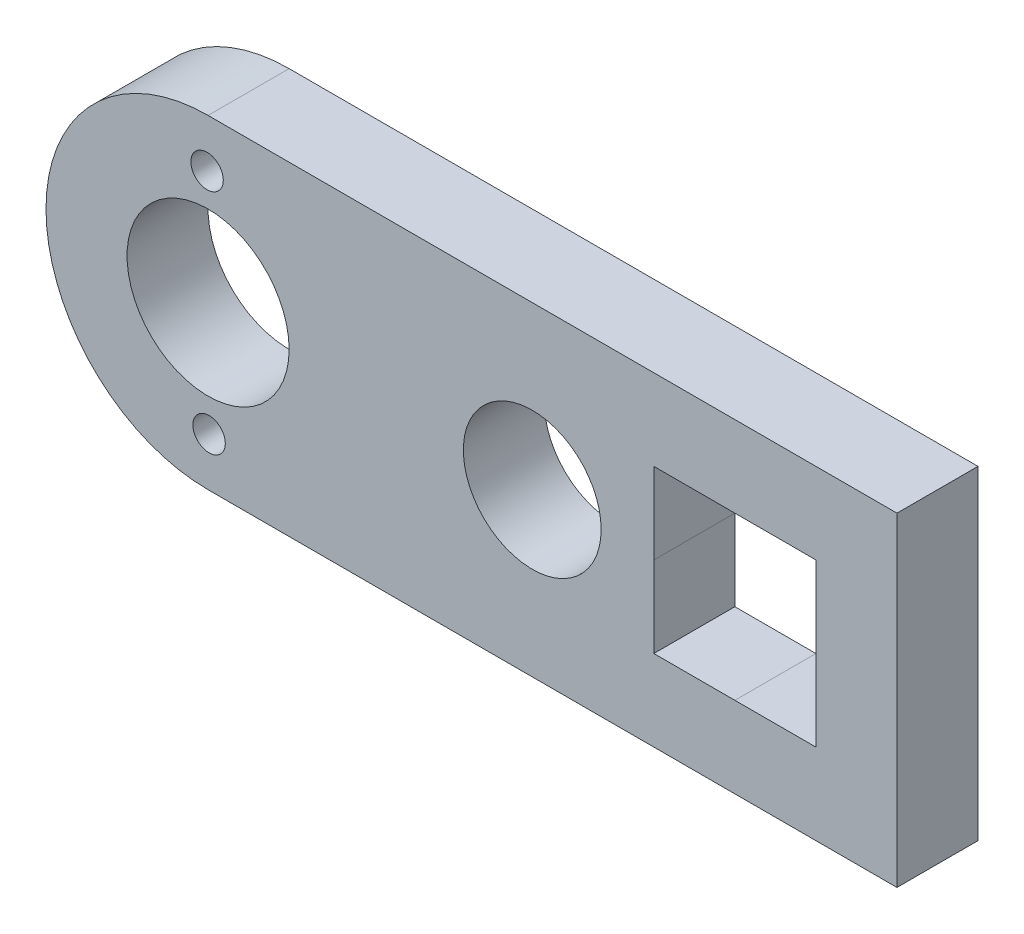
ISO-10303-21;
HEADER;
FILE_DESCRIPTION(('STEP AP214'),'2;1');
FILE_NAME('part.step','',(''),(''),'','','');
FILE_SCHEMA(('AUTOMOTIVE_DESIGN { 1 0 10303 214 1 1 1 1 }'));
ENDSEC;
DATA;
#1=APPLICATION_CONTEXT('core data for automotive mechanical design processes');
#2=APPLICATION_PROTOCOL_DEFINITION('international standard','automotive_design',2000,#1);
#3=PRODUCT_CONTEXT('',#1,'mechanical');
#4=PRODUCT('Part','Part','',(#3));
#5=PRODUCT_RELATED_PRODUCT_CATEGORY('part','',(#4));
#6=PRODUCT_DEFINITION_FORMATION('','',#4);
#7=PRODUCT_DEFINITION_CONTEXT('part definition',#1,'design');
#8=PRODUCT_DEFINITION('design','',#6,#7);
#9=PRODUCT_DEFINITION_SHAPE('','',#8);
#10=(LENGTH_UNIT() NAMED_UNIT(*) SI_UNIT(.MILLI.,.METRE.));
#11=(NAMED_UNIT(*) PLANE_ANGLE_UNIT() SI_UNIT($,.RADIAN.));
#12=(NAMED_UNIT(*) SI_UNIT($,.STERADIAN.) SOLID_ANGLE_UNIT());
#13=UNCERTAINTY_MEASURE_WITH_UNIT(LENGTH_MEASURE(1.E-05),#10,'distance_accuracy_value','');
#14=(GEOMETRIC_REPRESENTATION_CONTEXT(3) GLOBAL_UNCERTAINTY_ASSIGNED_CONTEXT((#13)) GLOBAL_UNIT_ASSIGNED_CONTEXT((#10,
#11,#12)) REPRESENTATION_CONTEXT('',''));
#15=CARTESIAN_POINT('',(0.,0.,0.));
#16=DIRECTION('',(0.,0.,1.));
#17=DIRECTION('',(1.,0.,0.));
#18=AXIS2_PLACEMENT_3D('',#15,#16,#17);
#19=CARTESIAN_POINT('',(0.,0.,5.));
#20=DIRECTION('',(0.,0.,1.));
#21=DIRECTION('',(1.,0.,0.));
#22=AXIS2_PLACEMENT_3D('',#19,#20,#21);
#23=PLANE('',#22);
#24=CARTESIAN_POINT('',(0.0624545754265805,-7.,5.));
#25=DIRECTION('',(0.,0.,1.));
#26=DIRECTION('',(1.,0.,0.));
#27=AXIS2_PLACEMENT_3D('',#24,#25,#26);
#28=CIRCLE('',#27,1.);
#29=CARTESIAN_POINT('',(1.06245457542658,-7.,5.));
#30=VERTEX_POINT('',#29);
#31=EDGE_CURVE('E349',#30,#30,#28,.T.);
#32=ORIENTED_EDGE('',*,*,#31,.F.);
#33=EDGE_LOOP('',(#32));
#34=FACE_BOUND('',#33,.T.);
#35=CARTESIAN_POINT('',(-0.0624545754265831,7.,5.));
#36=DIRECTION('',(0.,0.,1.));
#37=DIRECTION('',(1.,0.,0.));
#38=AXIS2_PLACEMENT_3D('',#35,#36,#37);
#39=CIRCLE('',#38,1.);
#40=CARTESIAN_POINT('',(0.937545424573417,7.,5.));
#41=VERTEX_POINT('',#40);
#42=EDGE_CURVE('E355',#41,#41,#39,.T.);
#43=ORIENTED_EDGE('',*,*,#42,.F.);
#44=EDGE_LOOP('',(#43));
#45=FACE_BOUND('',#44,.T.);
#46=CARTESIAN_POINT('',(0.,0.,5.));
#47=DIRECTION('',(0.,0.,1.));
#48=DIRECTION('',(1.,0.,0.));
#49=AXIS2_PLACEMENT_3D('',#46,#47,#48);
#50=CIRCLE('',#49,5.);
#51=CARTESIAN_POINT('',(5.,0.,5.));
#52=VERTEX_POINT('',#51);
#53=EDGE_CURVE('E361',#52,#52,#50,.T.);
#54=ORIENTED_EDGE('',*,*,#53,.F.);
#55=EDGE_LOOP('',(#54));
#56=FACE_BOUND('',#55,.T.);
#57=DIRECTION('',(1.,0.,0.));
#58=VECTOR('',#57,1.);
#59=CARTESIAN_POINT('',(0.,10.,5.));
#60=LINE('',#59,#58);
#61=CARTESIAN_POINT('',(0.,10.,5.));
#62=VERTEX_POINT('',#61);
#63=CARTESIAN_POINT('',(42.5,10.,5.));
#64=VERTEX_POINT('',#63);
#65=EDGE_CURVE('E367',#62,#64,#60,.T.);
#66=ORIENTED_EDGE('',*,*,#65,.F.);
#67=CARTESIAN_POINT('',(0.,0.,5.));
#68=DIRECTION('',(0.,0.,1.));
#69=DIRECTION('',(1.,0.,0.));
#70=AXIS2_PLACEMENT_3D('',#67,#68,#69);
#71=CIRCLE('',#70,10.);
#72=CARTESIAN_POINT('',(0.,-10.,5.));
#73=VERTEX_POINT('',#72);
#74=EDGE_CURVE('E376',#62,#73,#71,.T.);
#75=ORIENTED_EDGE('',*,*,#74,.T.);
#76=DIRECTION('',(1.,0.,0.));
#77=VECTOR('',#76,1.);
#78=CARTESIAN_POINT('',(0.,-10.,5.));
#79=LINE('',#78,#77);
#80=CARTESIAN_POINT('',(42.5,-10.,5.));
#81=VERTEX_POINT('',#80);
#82=EDGE_CURVE('E374',#73,#81,#79,.T.);
#83=ORIENTED_EDGE('',*,*,#82,.T.);
#84=DIRECTION('',(0.,-1.,0.));
#85=VECTOR('',#84,1.);
#86=CARTESIAN_POINT('',(42.5,10.,5.));
#87=LINE('',#86,#85);
#88=EDGE_CURVE('E370',#64,#81,#87,.T.);
#89=ORIENTED_EDGE('',*,*,#88,.F.);
#90=EDGE_LOOP('',(#66,#75,#83,#89));
#91=FACE_BOUND('',#90,.T.);
#92=CARTESIAN_POINT('',(20.,0.,5.));
#93=DIRECTION('',(0.,0.,1.));
#94=DIRECTION('',(1.,0.,0.));
#95=AXIS2_PLACEMENT_3D('',#92,#93,#94);
#96=CIRCLE('',#95,4.25000000000001);
#97=CARTESIAN_POINT('',(24.25,0.,5.));
#98=VERTEX_POINT('',#97);
#99=EDGE_CURVE('E316',#98,#98,#96,.T.);
#100=ORIENTED_EDGE('',*,*,#99,.F.);
#101=EDGE_LOOP('',(#100));
#102=FACE_BOUND('',#101,.T.);
#103=DIRECTION('',(0.,1.,0.));
#104=VECTOR('',#103,1.);
#105=CARTESIAN_POINT('',(37.5,-4.99999999999999,5.));
#106=LINE('',#105,#104);
#107=CARTESIAN_POINT('',(37.5,-4.99999999999999,5.));
#108=VERTEX_POINT('',#107);
#109=CARTESIAN_POINT('',(37.5,5.00000000000001,5.));
#110=VERTEX_POINT('',#109);
#111=EDGE_CURVE('E294',#108,#110,#106,.T.);
#112=ORIENTED_EDGE('',*,*,#111,.F.);
#113=DIRECTION('',(1.,0.,0.));
#114=VECTOR('',#113,1.);
#115=CARTESIAN_POINT('',(32.5,-4.99999999999999,5.));
#116=LINE('',#115,#114);
#117=CARTESIAN_POINT('',(32.5,-4.99999999999999,5.));
#118=VERTEX_POINT('',#117);
#119=EDGE_CURVE('E283',#118,#108,#116,.T.);
#120=ORIENTED_EDGE('',*,*,#119,.F.);
#121=DIRECTION('',(1.,0.,0.));
#122=VECTOR('',#121,1.);
#123=CARTESIAN_POINT('',(27.5,-4.99999999999999,5.));
#124=LINE('',#123,#122);
#125=CARTESIAN_POINT('',(27.5,-4.99999999999999,5.));
#126=VERTEX_POINT('',#125);
#127=EDGE_CURVE('E322',#126,#118,#124,.T.);
#128=ORIENTED_EDGE('',*,*,#127,.F.);
#129=DIRECTION('',(0.,-1.,0.));
#130=VECTOR('',#129,1.);
#131=CARTESIAN_POINT('',(27.5,0.,5.));
#132=LINE('',#131,#130);
#133=CARTESIAN_POINT('',(27.5,0.,5.));
#134=VERTEX_POINT('',#133);
#135=EDGE_CURVE('E324',#134,#126,#132,.T.);
#136=ORIENTED_EDGE('',*,*,#135,.F.);
#137=DIRECTION('',(0.,-1.,0.));
#138=VECTOR('',#137,1.);
#139=CARTESIAN_POINT('',(27.5,5.00000000000001,5.));
#140=LINE('',#139,#138);
#141=CARTESIAN_POINT('',(27.5,5.00000000000001,5.));
#142=VERTEX_POINT('',#141);
#143=EDGE_CURVE('E334',#142,#134,#140,.T.);
#144=ORIENTED_EDGE('',*,*,#143,.F.);
#145=DIRECTION('',(1.,0.,0.));
#146=VECTOR('',#145,1.);
#147=CARTESIAN_POINT('',(27.5,5.00000000000001,5.));
#148=LINE('',#147,#146);
#149=CARTESIAN_POINT('',(32.5,5.00000000000001,5.));
#150=VERTEX_POINT('',#149);
#151=EDGE_CURVE('E215',#142,#150,#148,.T.);
#152=ORIENTED_EDGE('',*,*,#151,.T.);
#153=DIRECTION('',(1.,0.,0.));
#154=VECTOR('',#153,1.);
#155=CARTESIAN_POINT('',(32.5,5.00000000000001,5.));
#156=LINE('',#155,#154);
#157=EDGE_CURVE('E306',#150,#110,#156,.T.);
#158=ORIENTED_EDGE('',*,*,#157,.T.);
#159=EDGE_LOOP('',(#112,#120,#128,#136,#144,#152,#158));
#160=FACE_BOUND('',#159,.T.);
#161=ADVANCED_FACE('F198',(#34,#45,#56,#91,#102,#160),#23,.T.);
#162=CARTESIAN_POINT('',(0.,0.,0.));
#163=DIRECTION('',(0.,0.,1.));
#164=DIRECTION('',(1.,0.,0.));
#165=AXIS2_PLACEMENT_3D('',#162,#163,#164);
#166=PLANE('',#165);
#167=CARTESIAN_POINT('',(20.,0.,0.));
#168=DIRECTION('',(0.,0.,1.));
#169=DIRECTION('',(1.,0.,0.));
#170=AXIS2_PLACEMENT_3D('',#167,#168,#169);
#171=CIRCLE('',#170,4.25000000000001);
#172=CARTESIAN_POINT('',(24.25,0.,0.));
#173=VERTEX_POINT('',#172);
#174=EDGE_CURVE('E302',#173,#173,#171,.T.);
#175=ORIENTED_EDGE('',*,*,#174,.T.);
#176=EDGE_LOOP('',(#175));
#177=FACE_BOUND('',#176,.T.);
#178=DIRECTION('',(1.,0.,0.));
#179=VECTOR('',#178,1.);
#180=CARTESIAN_POINT('',(0.,10.,0.));
#181=LINE('',#180,#179);
#182=CARTESIAN_POINT('',(0.,10.,0.));
#183=VERTEX_POINT('',#182);
#184=CARTESIAN_POINT('',(42.5,10.,0.));
#185=VERTEX_POINT('',#184);
#186=EDGE_CURVE('E364',#183,#185,#181,.T.);
#187=ORIENTED_EDGE('',*,*,#186,.T.);
#188=DIRECTION('',(0.,-1.,0.));
#189=VECTOR('',#188,1.);
#190=CARTESIAN_POINT('',(42.5,10.,0.));
#191=LINE('',#190,#189);
#192=CARTESIAN_POINT('',(42.5,-10.,0.));
#193=VERTEX_POINT('',#192);
#194=EDGE_CURVE('E380',#185,#193,#191,.T.);
#195=ORIENTED_EDGE('',*,*,#194,.T.);
#196=DIRECTION('',(1.,0.,0.));
#197=VECTOR('',#196,1.);
#198=CARTESIAN_POINT('',(0.,-10.,0.));
#199=LINE('',#198,#197);
#200=CARTESIAN_POINT('',(0.,-10.,0.));
#201=VERTEX_POINT('',#200);
#202=EDGE_CURVE('E383',#201,#193,#199,.T.);
#203=ORIENTED_EDGE('',*,*,#202,.F.);
#204=CARTESIAN_POINT('',(0.,0.,0.));
#205=DIRECTION('',(0.,0.,1.));
#206=DIRECTION('',(1.,0.,0.));
#207=AXIS2_PLACEMENT_3D('',#204,#205,#206);
#208=CIRCLE('',#207,10.);
#209=EDGE_CURVE('E371',#183,#201,#208,.T.);
#210=ORIENTED_EDGE('',*,*,#209,.F.);
#211=EDGE_LOOP('',(#187,#195,#203,#210));
#212=FACE_BOUND('',#211,.T.);
#213=CARTESIAN_POINT('',(0.,0.,0.));
#214=DIRECTION('',(0.,0.,1.));
#215=DIRECTION('',(1.,0.,0.));
#216=AXIS2_PLACEMENT_3D('',#213,#214,#215);
#217=CIRCLE('',#216,5.);
#218=CARTESIAN_POINT('',(5.,0.,0.));
#219=VERTEX_POINT('',#218);
#220=EDGE_CURVE('E358',#219,#219,#217,.T.);
#221=ORIENTED_EDGE('',*,*,#220,.T.);
#222=EDGE_LOOP('',(#221));
#223=FACE_BOUND('',#222,.T.);
#224=CARTESIAN_POINT('',(-0.0624545754265831,7.,0.));
#225=DIRECTION('',(0.,0.,1.));
#226=DIRECTION('',(1.,0.,0.));
#227=AXIS2_PLACEMENT_3D('',#224,#225,#226);
#228=CIRCLE('',#227,1.);
#229=CARTESIAN_POINT('',(0.937545424573417,7.,0.));
#230=VERTEX_POINT('',#229);
#231=EDGE_CURVE('E352',#230,#230,#228,.T.);
#232=ORIENTED_EDGE('',*,*,#231,.T.);
#233=EDGE_LOOP('',(#232));
#234=FACE_BOUND('',#233,.T.);
#235=CARTESIAN_POINT('',(0.0624545754265805,-7.,0.));
#236=DIRECTION('',(0.,0.,1.));
#237=DIRECTION('',(1.,0.,0.));
#238=AXIS2_PLACEMENT_3D('',#235,#236,#237);
#239=CIRCLE('',#238,1.);
#240=CARTESIAN_POINT('',(1.06245457542658,-7.,0.));
#241=VERTEX_POINT('',#240);
#242=EDGE_CURVE('E348',#241,#241,#239,.T.);
#243=ORIENTED_EDGE('',*,*,#242,.T.);
#244=EDGE_LOOP('',(#243));
#245=FACE_BOUND('',#244,.T.);
#246=DIRECTION('',(1.,0.,0.));
#247=VECTOR('',#246,1.);
#248=CARTESIAN_POINT('',(32.5,-4.99999999999999,0.));
#249=LINE('',#248,#247);
#250=CARTESIAN_POINT('',(32.5,-4.99999999999999,0.));
#251=VERTEX_POINT('',#250);
#252=CARTESIAN_POINT('',(37.5,-4.99999999999999,0.));
#253=VERTEX_POINT('',#252);
#254=EDGE_CURVE('E310',#251,#253,#249,.T.);
#255=ORIENTED_EDGE('',*,*,#254,.T.);
#256=DIRECTION('',(0.,1.,0.));
#257=VECTOR('',#256,1.);
#258=CARTESIAN_POINT('',(37.5,-4.99999999999999,0.));
#259=LINE('',#258,#257);
#260=CARTESIAN_POINT('',(37.5,5.00000000000001,0.));
#261=VERTEX_POINT('',#260);
#262=EDGE_CURVE('E301',#253,#261,#259,.T.);
#263=ORIENTED_EDGE('',*,*,#262,.T.);
#264=DIRECTION('',(1.,0.,0.));
#265=VECTOR('',#264,1.);
#266=CARTESIAN_POINT('',(32.5,5.00000000000001,0.));
#267=LINE('',#266,#265);
#268=CARTESIAN_POINT('',(32.5,5.00000000000001,0.));
#269=VERTEX_POINT('',#268);
#270=EDGE_CURVE('E295',#269,#261,#267,.T.);
#271=ORIENTED_EDGE('',*,*,#270,.F.);
#272=DIRECTION('',(1.,0.,0.));
#273=VECTOR('',#272,1.);
#274=CARTESIAN_POINT('',(27.5,5.00000000000001,0.));
#275=LINE('',#274,#273);
#276=CARTESIAN_POINT('',(27.5,5.00000000000001,0.));
#277=VERTEX_POINT('',#276);
#278=EDGE_CURVE('E332',#277,#269,#275,.T.);
#279=ORIENTED_EDGE('',*,*,#278,.F.);
#280=DIRECTION('',(0.,-1.,0.));
#281=VECTOR('',#280,1.);
#282=CARTESIAN_POINT('',(27.5,5.00000000000001,0.));
#283=LINE('',#282,#281);
#284=CARTESIAN_POINT('',(27.5,0.,0.));
#285=VERTEX_POINT('',#284);
#286=EDGE_CURVE('E335',#277,#285,#283,.T.);
#287=ORIENTED_EDGE('',*,*,#286,.T.);
#288=DIRECTION('',(0.,-1.,0.));
#289=VECTOR('',#288,1.);
#290=CARTESIAN_POINT('',(27.5,0.,0.));
#291=LINE('',#290,#289);
#292=CARTESIAN_POINT('',(27.5,-4.99999999999999,0.));
#293=VERTEX_POINT('',#292);
#294=EDGE_CURVE('E223',#285,#293,#291,.T.);
#295=ORIENTED_EDGE('',*,*,#294,.T.);
#296=DIRECTION('',(1.,0.,0.));
#297=VECTOR('',#296,1.);
#298=CARTESIAN_POINT('',(27.5,-4.99999999999999,0.));
#299=LINE('',#298,#297);
#300=EDGE_CURVE('E319',#293,#251,#299,.T.);
#301=ORIENTED_EDGE('',*,*,#300,.T.);
#302=EDGE_LOOP('',(#255,#263,#271,#279,#287,#295,#301));
#303=FACE_BOUND('',#302,.T.);
#304=ADVANCED_FACE('F400',(#177,#212,#223,#234,#245,#303),#166,.F.);
#305=CARTESIAN_POINT('',(0.,10.,5.));
#306=DIRECTION('',(0.,1.,0.));
#307=DIRECTION('',(-1.,0.,0.));
#308=AXIS2_PLACEMENT_3D('',#305,#306,#307);
#309=PLANE('',#308);
#310=ORIENTED_EDGE('',*,*,#186,.F.);
#311=DIRECTION('',(0.,0.,-1.));
#312=VECTOR('',#311,1.);
#313=CARTESIAN_POINT('',(0.,10.,5.));
#314=LINE('',#313,#312);
#315=EDGE_CURVE('E12',#62,#183,#314,.T.);
#316=ORIENTED_EDGE('',*,*,#315,.F.);
#317=ORIENTED_EDGE('',*,*,#65,.T.);
#318=DIRECTION('',(0.,0.,-1.));
#319=VECTOR('',#318,1.);
#320=CARTESIAN_POINT('',(42.5,10.,5.));
#321=LINE('',#320,#319);
#322=EDGE_CURVE('E202',#64,#185,#321,.T.);
#323=ORIENTED_EDGE('',*,*,#322,.T.);
#324=EDGE_LOOP('',(#310,#316,#317,#323));
#325=FACE_BOUND('',#324,.T.);
#326=ADVANCED_FACE('F200',(#325),#309,.T.);
#327=CARTESIAN_POINT('',(0.,0.,5.));
#328=DIRECTION('',(0.,0.,-1.));
#329=DIRECTION('',(-1.,0.,0.));
#330=AXIS2_PLACEMENT_3D('',#327,#328,#329);
#331=CYLINDRICAL_SURFACE('',#330,10.);
#332=ORIENTED_EDGE('',*,*,#209,.T.);
#333=DIRECTION('',(0.,0.,-1.));
#334=VECTOR('',#333,1.);
#335=CARTESIAN_POINT('',(0.,-10.,5.));
#336=LINE('',#335,#334);
#337=EDGE_CURVE('E207',#73,#201,#336,.T.);
#338=ORIENTED_EDGE('',*,*,#337,.F.);
#339=ORIENTED_EDGE('',*,*,#74,.F.);
#340=ORIENTED_EDGE('',*,*,#315,.T.);
#341=EDGE_LOOP('',(#332,#338,#339,#340));
#342=FACE_BOUND('',#341,.T.);
#343=ADVANCED_FACE('F404',(#342),#331,.T.);
#344=CARTESIAN_POINT('',(0.,-10.,5.));
#345=DIRECTION('',(0.,1.,0.));
#346=DIRECTION('',(0.,0.,1.));
#347=AXIS2_PLACEMENT_3D('',#344,#345,#346);
#348=PLANE('',#347);
#349=ORIENTED_EDGE('',*,*,#202,.T.);
#350=DIRECTION('',(0.,0.,-1.));
#351=VECTOR('',#350,1.);
#352=CARTESIAN_POINT('',(42.5,-10.,5.));
#353=LINE('',#352,#351);
#354=EDGE_CURVE('E388',#81,#193,#353,.T.);
#355=ORIENTED_EDGE('',*,*,#354,.F.);
#356=ORIENTED_EDGE('',*,*,#82,.F.);
#357=ORIENTED_EDGE('',*,*,#337,.T.);
#358=EDGE_LOOP('',(#349,#355,#356,#357));
#359=FACE_BOUND('',#358,.T.);
#360=ADVANCED_FACE('F408',(#359),#348,.F.);
#361=CARTESIAN_POINT('',(42.5,10.,5.));
#362=DIRECTION('',(1.,0.,0.));
#363=DIRECTION('',(0.,0.,-1.));
#364=AXIS2_PLACEMENT_3D('',#361,#362,#363);
#365=PLANE('',#364);
#366=ORIENTED_EDGE('',*,*,#194,.F.);
#367=ORIENTED_EDGE('',*,*,#322,.F.);
#368=ORIENTED_EDGE('',*,*,#88,.T.);
#369=ORIENTED_EDGE('',*,*,#354,.T.);
#370=EDGE_LOOP('',(#366,#367,#368,#369));
#371=FACE_BOUND('',#370,.T.);
#372=ADVANCED_FACE('F396',(#371),#365,.T.);
#373=CARTESIAN_POINT('',(0.,0.,5.));
#374=DIRECTION('',(0.,0.,-1.));
#375=DIRECTION('',(-1.,0.,0.));
#376=AXIS2_PLACEMENT_3D('',#373,#374,#375);
#377=CYLINDRICAL_SURFACE('',#376,5.);
#378=ORIENTED_EDGE('',*,*,#53,.T.);
#379=EDGE_LOOP('',(#378));
#380=FACE_BOUND('',#379,.T.);
#381=ORIENTED_EDGE('',*,*,#220,.F.);
#382=EDGE_LOOP('',(#381));
#383=FACE_BOUND('',#382,.T.);
#384=ADVANCED_FACE('F434',(#380,#383),#377,.F.);
#385=CARTESIAN_POINT('',(-0.0624545754265831,7.,5.));
#386=DIRECTION('',(0.,0.,-1.));
#387=DIRECTION('',(-1.,0.,0.));
#388=AXIS2_PLACEMENT_3D('',#385,#386,#387);
#389=CYLINDRICAL_SURFACE('',#388,1.);
#390=ORIENTED_EDGE('',*,*,#42,.T.);
#391=EDGE_LOOP('',(#390));
#392=FACE_BOUND('',#391,.T.);
#393=ORIENTED_EDGE('',*,*,#231,.F.);
#394=EDGE_LOOP('',(#393));
#395=FACE_BOUND('',#394,.T.);
#396=ADVANCED_FACE('F438',(#392,#395),#389,.F.);
#397=CARTESIAN_POINT('',(0.0624545754265805,-7.,5.));
#398=DIRECTION('',(0.,0.,-1.));
#399=DIRECTION('',(-1.,0.,0.));
#400=AXIS2_PLACEMENT_3D('',#397,#398,#399);
#401=CYLINDRICAL_SURFACE('',#400,1.);
#402=ORIENTED_EDGE('',*,*,#31,.T.);
#403=EDGE_LOOP('',(#402));
#404=FACE_BOUND('',#403,.T.);
#405=ORIENTED_EDGE('',*,*,#242,.F.);
#406=EDGE_LOOP('',(#405));
#407=FACE_BOUND('',#406,.T.);
#408=ADVANCED_FACE('F443',(#404,#407),#401,.F.);
#409=CARTESIAN_POINT('',(27.5,5.00000000000001,5.));
#410=DIRECTION('',(0.,1.,0.));
#411=DIRECTION('',(0.,0.,1.));
#412=AXIS2_PLACEMENT_3D('',#409,#410,#411);
#413=PLANE('',#412);
#414=ORIENTED_EDGE('',*,*,#278,.T.);
#415=DIRECTION('',(0.,0.,-1.));
#416=VECTOR('',#415,1.);
#417=CARTESIAN_POINT('',(32.5,5.00000000000001,5.));
#418=LINE('',#417,#416);
#419=EDGE_CURVE('E346',#150,#269,#418,.T.);
#420=ORIENTED_EDGE('',*,*,#419,.F.);
#421=ORIENTED_EDGE('',*,*,#151,.F.);
#422=DIRECTION('',(0.,0.,-1.));
#423=VECTOR('',#422,1.);
#424=CARTESIAN_POINT('',(27.5,5.00000000000001,5.));
#425=LINE('',#424,#423);
#426=EDGE_CURVE('E344',#142,#277,#425,.T.);
#427=ORIENTED_EDGE('',*,*,#426,.T.);
#428=EDGE_LOOP('',(#414,#420,#421,#427));
#429=FACE_BOUND('',#428,.T.);
#430=ADVANCED_FACE('F450',(#429),#413,.F.);
#431=CARTESIAN_POINT('',(27.5,5.00000000000001,5.));
#432=DIRECTION('',(1.,0.,0.));
#433=DIRECTION('',(0.,0.,-1.));
#434=AXIS2_PLACEMENT_3D('',#431,#432,#433);
#435=PLANE('',#434);
#436=ORIENTED_EDGE('',*,*,#286,.F.);
#437=ORIENTED_EDGE('',*,*,#426,.F.);
#438=ORIENTED_EDGE('',*,*,#143,.T.);
#439=DIRECTION('',(0.,0.,-1.));
#440=VECTOR('',#439,1.);
#441=CARTESIAN_POINT('',(27.5,0.,5.));
#442=LINE('',#441,#440);
#443=EDGE_CURVE('E338',#134,#285,#442,.T.);
#444=ORIENTED_EDGE('',*,*,#443,.T.);
#445=EDGE_LOOP('',(#436,#437,#438,#444));
#446=FACE_BOUND('',#445,.T.);
#447=ADVANCED_FACE('F454',(#446),#435,.T.);
#448=CARTESIAN_POINT('',(27.5,-4.99999999999999,5.));
#449=DIRECTION('',(0.,1.,0.));
#450=DIRECTION('',(0.,0.,1.));
#451=AXIS2_PLACEMENT_3D('',#448,#449,#450);
#452=PLANE('',#451);
#453=ORIENTED_EDGE('',*,*,#300,.F.);
#454=DIRECTION('',(0.,0.,-1.));
#455=VECTOR('',#454,1.);
#456=CARTESIAN_POINT('',(27.5,-4.99999999999999,5.));
#457=LINE('',#456,#455);
#458=EDGE_CURVE('E326',#126,#293,#457,.T.);
#459=ORIENTED_EDGE('',*,*,#458,.F.);
#460=ORIENTED_EDGE('',*,*,#127,.T.);
#461=DIRECTION('',(0.,0.,-1.));
#462=VECTOR('',#461,1.);
#463=CARTESIAN_POINT('',(32.5,-4.99999999999999,5.));
#464=LINE('',#463,#462);
#465=EDGE_CURVE('E289',#118,#251,#464,.T.);
#466=ORIENTED_EDGE('',*,*,#465,.T.);
#467=EDGE_LOOP('',(#453,#459,#460,#466));
#468=FACE_BOUND('',#467,.T.);
#469=ADVANCED_FACE('F457',(#468),#452,.T.);
#470=CARTESIAN_POINT('',(27.5,0.,5.));
#471=DIRECTION('',(1.,0.,0.));
#472=DIRECTION('',(0.,0.,-1.));
#473=AXIS2_PLACEMENT_3D('',#470,#471,#472);
#474=PLANE('',#473);
#475=ORIENTED_EDGE('',*,*,#294,.F.);
#476=ORIENTED_EDGE('',*,*,#443,.F.);
#477=ORIENTED_EDGE('',*,*,#135,.T.);
#478=ORIENTED_EDGE('',*,*,#458,.T.);
#479=EDGE_LOOP('',(#475,#476,#477,#478));
#480=FACE_BOUND('',#479,.T.);
#481=ADVANCED_FACE('F419',(#480),#474,.T.);
#482=CARTESIAN_POINT('',(20.,0.,5.));
#483=DIRECTION('',(0.,0.,-1.));
#484=DIRECTION('',(-1.,0.,0.));
#485=AXIS2_PLACEMENT_3D('',#482,#483,#484);
#486=CYLINDRICAL_SURFACE('',#485,4.25000000000001);
#487=ORIENTED_EDGE('',*,*,#99,.T.);
#488=EDGE_LOOP('',(#487));
#489=FACE_BOUND('',#488,.T.);
#490=ORIENTED_EDGE('',*,*,#174,.F.);
#491=EDGE_LOOP('',(#490));
#492=FACE_BOUND('',#491,.T.);
#493=ADVANCED_FACE('F416',(#489,#492),#486,.F.);
#494=CARTESIAN_POINT('',(32.5,-4.99999999999999,5.));
#495=DIRECTION('',(0.,1.,0.));
#496=DIRECTION('',(0.,0.,1.));
#497=AXIS2_PLACEMENT_3D('',#494,#495,#496);
#498=PLANE('',#497);
#499=ORIENTED_EDGE('',*,*,#254,.F.);
#500=ORIENTED_EDGE('',*,*,#465,.F.);
#501=ORIENTED_EDGE('',*,*,#119,.T.);
#502=DIRECTION('',(0.,0.,-1.));
#503=VECTOR('',#502,1.);
#504=CARTESIAN_POINT('',(37.5,-4.99999999999999,5.));
#505=LINE('',#504,#503);
#506=EDGE_CURVE('E286',#108,#253,#505,.T.);
#507=ORIENTED_EDGE('',*,*,#506,.T.);
#508=EDGE_LOOP('',(#499,#500,#501,#507));
#509=FACE_BOUND('',#508,.T.);
#510=ADVANCED_FACE('F285',(#509),#498,.T.);
#511=CARTESIAN_POINT('',(37.5,-4.99999999999999,5.));
#512=DIRECTION('',(-1.,0.,0.));
#513=DIRECTION('',(0.,0.,1.));
#514=AXIS2_PLACEMENT_3D('',#511,#512,#513);
#515=PLANE('',#514);
#516=ORIENTED_EDGE('',*,*,#262,.F.);
#517=ORIENTED_EDGE('',*,*,#506,.F.);
#518=ORIENTED_EDGE('',*,*,#111,.T.);
#519=DIRECTION('',(0.,0.,-1.));
#520=VECTOR('',#519,1.);
#521=CARTESIAN_POINT('',(37.5,5.00000000000001,5.));
#522=LINE('',#521,#520);
#523=EDGE_CURVE('E303',#110,#261,#522,.T.);
#524=ORIENTED_EDGE('',*,*,#523,.T.);
#525=EDGE_LOOP('',(#516,#517,#518,#524));
#526=FACE_BOUND('',#525,.T.);
#527=ADVANCED_FACE('F298',(#526),#515,.T.);
#528=CARTESIAN_POINT('',(32.5,5.00000000000001,5.));
#529=DIRECTION('',(0.,1.,0.));
#530=DIRECTION('',(-1.,0.,0.));
#531=AXIS2_PLACEMENT_3D('',#528,#529,#530);
#532=PLANE('',#531);
#533=ORIENTED_EDGE('',*,*,#270,.T.);
#534=ORIENTED_EDGE('',*,*,#523,.F.);
#535=ORIENTED_EDGE('',*,*,#157,.F.);
#536=ORIENTED_EDGE('',*,*,#419,.T.);
#537=EDGE_LOOP('',(#533,#534,#535,#536));
#538=FACE_BOUND('',#537,.T.);
#539=ADVANCED_FACE('F468',(#538),#532,.F.);
#540=CLOSED_SHELL('',(#161,#304,#326,#343,#360,#372,#384,#396,#408,#430,#447,#469,#481,#493,
#510,#527,#539));
#541=MANIFOLD_SOLID_BREP('B2',#540);
#542=ADVANCED_BREP_SHAPE_REPRESENTATION('',(#18,#541),#14);
#543=SHAPE_DEFINITION_REPRESENTATION(#9,#542);
ENDSEC;
END-ISO-10303-21;
